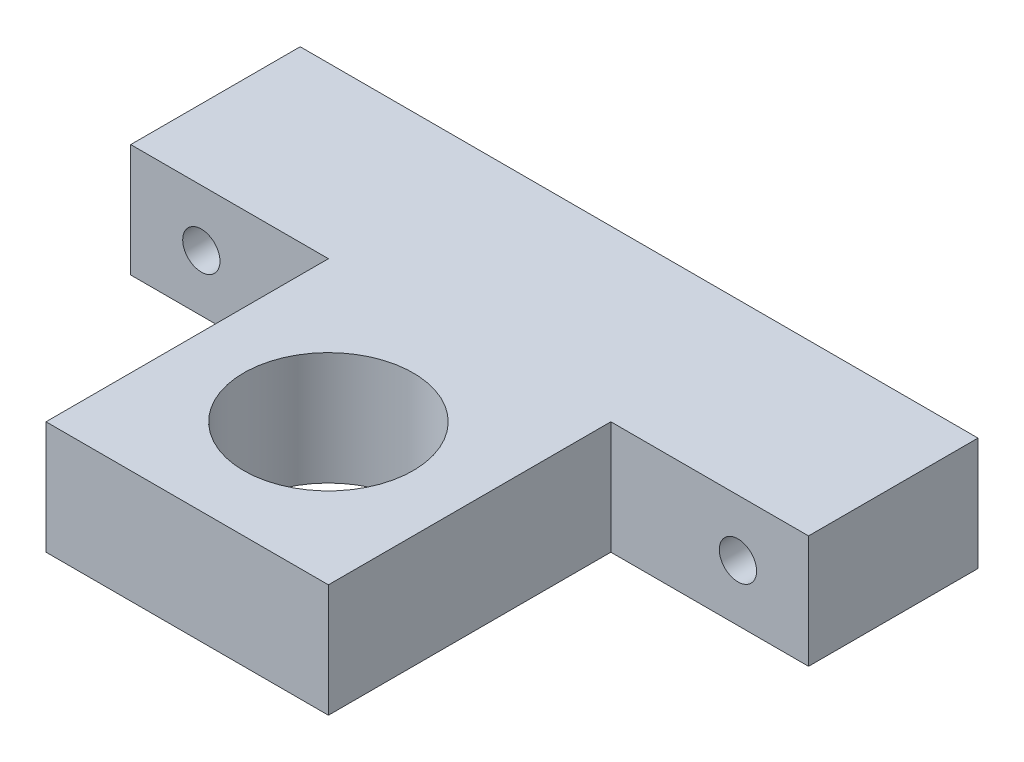
ISO-10303-21;
HEADER;
FILE_DESCRIPTION(('STEP AP214'),'2;1');
FILE_NAME('part.step','',(''),(''),'','','');
FILE_SCHEMA(('AUTOMOTIVE_DESIGN { 1 0 10303 214 1 1 1 1 }'));
ENDSEC;
DATA;
#1=APPLICATION_CONTEXT('core data for automotive mechanical design processes');
#2=APPLICATION_PROTOCOL_DEFINITION('international standard','automotive_design',2000,#1);
#3=PRODUCT_CONTEXT('',#1,'mechanical');
#4=PRODUCT('Part','Part','',(#3));
#5=PRODUCT_RELATED_PRODUCT_CATEGORY('part','',(#4));
#6=PRODUCT_DEFINITION_FORMATION('','',#4);
#7=PRODUCT_DEFINITION_CONTEXT('part definition',#1,'design');
#8=PRODUCT_DEFINITION('design','',#6,#7);
#9=PRODUCT_DEFINITION_SHAPE('','',#8);
#10=(LENGTH_UNIT() NAMED_UNIT(*) SI_UNIT(.MILLI.,.METRE.));
#11=(NAMED_UNIT(*) PLANE_ANGLE_UNIT() SI_UNIT($,.RADIAN.));
#12=(NAMED_UNIT(*) SI_UNIT($,.STERADIAN.) SOLID_ANGLE_UNIT());
#13=UNCERTAINTY_MEASURE_WITH_UNIT(LENGTH_MEASURE(1.E-05),#10,'distance_accuracy_value','');
#14=(GEOMETRIC_REPRESENTATION_CONTEXT(3) GLOBAL_UNCERTAINTY_ASSIGNED_CONTEXT((#13)) GLOBAL_UNIT_ASSIGNED_CONTEXT((#10,
#11,#12)) REPRESENTATION_CONTEXT('',''));
#15=CARTESIAN_POINT('',(0.,0.,0.));
#16=DIRECTION('',(0.,0.,1.));
#17=DIRECTION('',(1.,0.,0.));
#18=AXIS2_PLACEMENT_3D('',#15,#16,#17);
#19=CARTESIAN_POINT('',(0.,5.,0.));
#20=DIRECTION('',(0.,-1.,0.));
#21=DIRECTION('',(0.,0.,-1.));
#22=AXIS2_PLACEMENT_3D('',#19,#20,#21);
#23=PLANE('',#22);
#24=DIRECTION('',(1.,0.,0.));
#25=VECTOR('',#24,1.);
#26=CARTESIAN_POINT('',(12.5,5.,40.));
#27=LINE('',#26,#25);
#28=CARTESIAN_POINT('',(-12.5,5.,40.));
#29=VERTEX_POINT('',#28);
#30=CARTESIAN_POINT('',(12.5,5.,40.));
#31=VERTEX_POINT('',#30);
#32=EDGE_CURVE('E147',#29,#31,#27,.T.);
#33=ORIENTED_EDGE('',*,*,#32,.T.);
#34=DIRECTION('',(0.,0.,-1.));
#35=VECTOR('',#34,1.);
#36=CARTESIAN_POINT('',(12.5,5.,40.));
#37=LINE('',#36,#35);
#38=CARTESIAN_POINT('',(12.5,5.,15.));
#39=VERTEX_POINT('',#38);
#40=EDGE_CURVE('E95',#31,#39,#37,.T.);
#41=ORIENTED_EDGE('',*,*,#40,.T.);
#42=DIRECTION('',(1.,0.,0.));
#43=VECTOR('',#42,1.);
#44=CARTESIAN_POINT('',(12.5,5.,15.));
#45=LINE('',#44,#43);
#46=CARTESIAN_POINT('',(30.,5.,15.));
#47=VERTEX_POINT('',#46);
#48=EDGE_CURVE('E162',#39,#47,#45,.T.);
#49=ORIENTED_EDGE('',*,*,#48,.T.);
#50=DIRECTION('',(0.,0.,-1.));
#51=VECTOR('',#50,1.);
#52=CARTESIAN_POINT('',(30.,5.,15.));
#53=LINE('',#52,#51);
#54=CARTESIAN_POINT('',(30.,5.,0.));
#55=VERTEX_POINT('',#54);
#56=EDGE_CURVE('E175',#47,#55,#53,.T.);
#57=ORIENTED_EDGE('',*,*,#56,.T.);
#58=DIRECTION('',(-1.,0.,0.));
#59=VECTOR('',#58,1.);
#60=CARTESIAN_POINT('',(-30.,5.,0.));
#61=LINE('',#60,#59);
#62=CARTESIAN_POINT('',(-30.,5.,0.));
#63=VERTEX_POINT('',#62);
#64=EDGE_CURVE('E114',#55,#63,#61,.T.);
#65=ORIENTED_EDGE('',*,*,#64,.T.);
#66=DIRECTION('',(0.,0.,1.));
#67=VECTOR('',#66,1.);
#68=CARTESIAN_POINT('',(-30.,5.,15.));
#69=LINE('',#68,#67);
#70=CARTESIAN_POINT('',(-30.,5.,15.));
#71=VERTEX_POINT('',#70);
#72=EDGE_CURVE('E108',#63,#71,#69,.T.);
#73=ORIENTED_EDGE('',*,*,#72,.T.);
#74=DIRECTION('',(1.,0.,0.));
#75=VECTOR('',#74,1.);
#76=CARTESIAN_POINT('',(-12.5,5.,15.));
#77=LINE('',#76,#75);
#78=CARTESIAN_POINT('',(-12.5,5.,15.));
#79=VERTEX_POINT('',#78);
#80=EDGE_CURVE('E112',#71,#79,#77,.T.);
#81=ORIENTED_EDGE('',*,*,#80,.T.);
#82=DIRECTION('',(0.,0.,1.));
#83=VECTOR('',#82,1.);
#84=CARTESIAN_POINT('',(-12.5,5.,40.));
#85=LINE('',#84,#83);
#86=EDGE_CURVE('E52',#79,#29,#85,.T.);
#87=ORIENTED_EDGE('',*,*,#86,.T.);
#88=EDGE_LOOP('',(#33,#41,#49,#57,#65,#73,#81,#87));
#89=FACE_BOUND('',#88,.T.);
#90=CARTESIAN_POINT('',(0.,5.,27.5));
#91=DIRECTION('',(0.,1.,0.));
#92=DIRECTION('',(0.,0.,1.));
#93=AXIS2_PLACEMENT_3D('',#90,#91,#92);
#94=CIRCLE('',#93,7.5);
#95=CARTESIAN_POINT('',(0.,5.,35.));
#96=VERTEX_POINT('',#95);
#97=EDGE_CURVE('E136',#96,#96,#94,.T.);
#98=ORIENTED_EDGE('',*,*,#97,.F.);
#99=EDGE_LOOP('',(#98));
#100=FACE_BOUND('',#99,.T.);
#101=ADVANCED_FACE('F35',(#89,#100),#23,.F.);
#102=CARTESIAN_POINT('',(0.,-5.,0.));
#103=DIRECTION('',(0.,-1.,0.));
#104=DIRECTION('',(0.,0.,-1.));
#105=AXIS2_PLACEMENT_3D('',#102,#103,#104);
#106=PLANE('',#105);
#107=DIRECTION('',(1.,0.,0.));
#108=VECTOR('',#107,1.);
#109=CARTESIAN_POINT('',(12.5,-5.,40.));
#110=LINE('',#109,#108);
#111=CARTESIAN_POINT('',(-12.5,-5.,40.));
#112=VERTEX_POINT('',#111);
#113=CARTESIAN_POINT('',(12.5,-5.,40.));
#114=VERTEX_POINT('',#113);
#115=EDGE_CURVE('E132',#112,#114,#110,.T.);
#116=ORIENTED_EDGE('',*,*,#115,.F.);
#117=DIRECTION('',(0.,0.,1.));
#118=VECTOR('',#117,1.);
#119=CARTESIAN_POINT('',(-12.5,-5.,40.));
#120=LINE('',#119,#118);
#121=CARTESIAN_POINT('',(-12.5,-5.,15.));
#122=VERTEX_POINT('',#121);
#123=EDGE_CURVE('E87',#122,#112,#120,.T.);
#124=ORIENTED_EDGE('',*,*,#123,.F.);
#125=DIRECTION('',(1.,0.,0.));
#126=VECTOR('',#125,1.);
#127=CARTESIAN_POINT('',(-12.5,-5.,15.));
#128=LINE('',#127,#126);
#129=CARTESIAN_POINT('',(-30.,-5.,15.));
#130=VERTEX_POINT('',#129);
#131=EDGE_CURVE('E81',#130,#122,#128,.T.);
#132=ORIENTED_EDGE('',*,*,#131,.F.);
#133=DIRECTION('',(0.,0.,1.));
#134=VECTOR('',#133,1.);
#135=CARTESIAN_POINT('',(-30.,-5.,15.));
#136=LINE('',#135,#134);
#137=CARTESIAN_POINT('',(-30.,-5.,0.));
#138=VERTEX_POINT('',#137);
#139=EDGE_CURVE('E122',#138,#130,#136,.T.);
#140=ORIENTED_EDGE('',*,*,#139,.F.);
#141=DIRECTION('',(-1.,0.,0.));
#142=VECTOR('',#141,1.);
#143=CARTESIAN_POINT('',(-30.,-5.,0.));
#144=LINE('',#143,#142);
#145=CARTESIAN_POINT('',(30.,-5.,0.));
#146=VERTEX_POINT('',#145);
#147=EDGE_CURVE('E142',#146,#138,#144,.T.);
#148=ORIENTED_EDGE('',*,*,#147,.F.);
#149=DIRECTION('',(0.,0.,-1.));
#150=VECTOR('',#149,1.);
#151=CARTESIAN_POINT('',(30.,-5.,15.));
#152=LINE('',#151,#150);
#153=CARTESIAN_POINT('',(30.,-5.,15.));
#154=VERTEX_POINT('',#153);
#155=EDGE_CURVE('E140',#154,#146,#152,.T.);
#156=ORIENTED_EDGE('',*,*,#155,.F.);
#157=DIRECTION('',(1.,0.,0.));
#158=VECTOR('',#157,1.);
#159=CARTESIAN_POINT('',(12.5,-5.,15.));
#160=LINE('',#159,#158);
#161=CARTESIAN_POINT('',(12.5,-5.,15.));
#162=VERTEX_POINT('',#161);
#163=EDGE_CURVE('E138',#162,#154,#160,.T.);
#164=ORIENTED_EDGE('',*,*,#163,.F.);
#165=DIRECTION('',(0.,0.,-1.));
#166=VECTOR('',#165,1.);
#167=CARTESIAN_POINT('',(12.5,-5.,40.));
#168=LINE('',#167,#166);
#169=EDGE_CURVE('E135',#114,#162,#168,.T.);
#170=ORIENTED_EDGE('',*,*,#169,.F.);
#171=EDGE_LOOP('',(#116,#124,#132,#140,#148,#156,#164,#170));
#172=FACE_BOUND('',#171,.T.);
#173=CARTESIAN_POINT('',(0.,-5.,27.5));
#174=DIRECTION('',(0.,1.,0.));
#175=DIRECTION('',(0.,0.,1.));
#176=AXIS2_PLACEMENT_3D('',#173,#174,#175);
#177=CIRCLE('',#176,7.5);
#178=CARTESIAN_POINT('',(0.,-5.,35.));
#179=VERTEX_POINT('',#178);
#180=EDGE_CURVE('E181',#179,#179,#177,.T.);
#181=ORIENTED_EDGE('',*,*,#180,.T.);
#182=EDGE_LOOP('',(#181));
#183=FACE_BOUND('',#182,.T.);
#184=ADVANCED_FACE('F166',(#172,#183),#106,.T.);
#185=CARTESIAN_POINT('',(12.5,5.,40.));
#186=DIRECTION('',(0.,0.,-1.));
#187=DIRECTION('',(-1.,0.,0.));
#188=AXIS2_PLACEMENT_3D('',#185,#186,#187);
#189=PLANE('',#188);
#190=ORIENTED_EDGE('',*,*,#115,.T.);
#191=DIRECTION('',(0.,-1.,0.));
#192=VECTOR('',#191,1.);
#193=CARTESIAN_POINT('',(12.5,5.,40.));
#194=LINE('',#193,#192);
#195=EDGE_CURVE('E11',#31,#114,#194,.T.);
#196=ORIENTED_EDGE('',*,*,#195,.F.);
#197=ORIENTED_EDGE('',*,*,#32,.F.);
#198=DIRECTION('',(0.,-1.,0.));
#199=VECTOR('',#198,1.);
#200=CARTESIAN_POINT('',(-12.5,5.,40.));
#201=LINE('',#200,#199);
#202=EDGE_CURVE('E128',#29,#112,#201,.T.);
#203=ORIENTED_EDGE('',*,*,#202,.T.);
#204=EDGE_LOOP('',(#190,#196,#197,#203));
#205=FACE_BOUND('',#204,.T.);
#206=ADVANCED_FACE('F37',(#205),#189,.F.);
#207=CARTESIAN_POINT('',(12.5,5.,40.));
#208=DIRECTION('',(-1.,0.,0.));
#209=DIRECTION('',(0.,0.,1.));
#210=AXIS2_PLACEMENT_3D('',#207,#208,#209);
#211=PLANE('',#210);
#212=ORIENTED_EDGE('',*,*,#169,.T.);
#213=DIRECTION('',(0.,-1.,0.));
#214=VECTOR('',#213,1.);
#215=CARTESIAN_POINT('',(12.5,5.,15.));
#216=LINE('',#215,#214);
#217=EDGE_CURVE('E44',#39,#162,#216,.T.);
#218=ORIENTED_EDGE('',*,*,#217,.F.);
#219=ORIENTED_EDGE('',*,*,#40,.F.);
#220=ORIENTED_EDGE('',*,*,#195,.T.);
#221=EDGE_LOOP('',(#212,#218,#219,#220));
#222=FACE_BOUND('',#221,.T.);
#223=ADVANCED_FACE('F272',(#222),#211,.F.);
#224=CARTESIAN_POINT('',(12.5,5.,15.));
#225=DIRECTION('',(0.,0.,-1.));
#226=DIRECTION('',(-1.,0.,0.));
#227=AXIS2_PLACEMENT_3D('',#224,#225,#226);
#228=PLANE('',#227);
#229=CARTESIAN_POINT('',(23.75,0.,15.));
#230=DIRECTION('',(0.,0.,-1.));
#231=DIRECTION('',(-1.,0.,0.));
#232=AXIS2_PLACEMENT_3D('',#229,#230,#231);
#233=CIRCLE('',#232,1.64999999999999);
#234=CARTESIAN_POINT('',(22.1,0.,15.));
#235=VERTEX_POINT('',#234);
#236=EDGE_CURVE('E192',#235,#235,#233,.T.);
#237=ORIENTED_EDGE('',*,*,#236,.T.);
#238=EDGE_LOOP('',(#237));
#239=FACE_BOUND('',#238,.T.);
#240=ORIENTED_EDGE('',*,*,#163,.T.);
#241=DIRECTION('',(0.,-1.,0.));
#242=VECTOR('',#241,1.);
#243=CARTESIAN_POINT('',(30.,5.,15.));
#244=LINE('',#243,#242);
#245=EDGE_CURVE('E154',#47,#154,#244,.T.);
#246=ORIENTED_EDGE('',*,*,#245,.F.);
#247=ORIENTED_EDGE('',*,*,#48,.F.);
#248=ORIENTED_EDGE('',*,*,#217,.T.);
#249=EDGE_LOOP('',(#240,#246,#247,#248));
#250=FACE_BOUND('',#249,.T.);
#251=ADVANCED_FACE('F160',(#239,#250),#228,.F.);
#252=CARTESIAN_POINT('',(30.,5.,15.));
#253=DIRECTION('',(-1.,0.,0.));
#254=DIRECTION('',(0.,0.,1.));
#255=AXIS2_PLACEMENT_3D('',#252,#253,#254);
#256=PLANE('',#255);
#257=ORIENTED_EDGE('',*,*,#155,.T.);
#258=DIRECTION('',(0.,-1.,0.));
#259=VECTOR('',#258,1.);
#260=CARTESIAN_POINT('',(30.,5.,0.));
#261=LINE('',#260,#259);
#262=EDGE_CURVE('E151',#55,#146,#261,.T.);
#263=ORIENTED_EDGE('',*,*,#262,.F.);
#264=ORIENTED_EDGE('',*,*,#56,.F.);
#265=ORIENTED_EDGE('',*,*,#245,.T.);
#266=EDGE_LOOP('',(#257,#263,#264,#265));
#267=FACE_BOUND('',#266,.T.);
#268=ADVANCED_FACE('F171',(#267),#256,.F.);
#269=CARTESIAN_POINT('',(-30.,5.,0.));
#270=DIRECTION('',(0.,0.,1.));
#271=DIRECTION('',(1.,0.,0.));
#272=AXIS2_PLACEMENT_3D('',#269,#270,#271);
#273=PLANE('',#272);
#274=CARTESIAN_POINT('',(23.75,0.,0.));
#275=DIRECTION('',(0.,0.,-1.));
#276=DIRECTION('',(-1.,0.,0.));
#277=AXIS2_PLACEMENT_3D('',#274,#275,#276);
#278=CIRCLE('',#277,1.64999999999999);
#279=CARTESIAN_POINT('',(22.1,0.,0.));
#280=VERTEX_POINT('',#279);
#281=EDGE_CURVE('E195',#280,#280,#278,.T.);
#282=ORIENTED_EDGE('',*,*,#281,.F.);
#283=EDGE_LOOP('',(#282));
#284=FACE_BOUND('',#283,.T.);
#285=CARTESIAN_POINT('',(-23.75,0.,0.));
#286=DIRECTION('',(0.,0.,-1.));
#287=DIRECTION('',(-1.,0.,0.));
#288=AXIS2_PLACEMENT_3D('',#285,#286,#287);
#289=CIRCLE('',#288,1.64999999999999);
#290=CARTESIAN_POINT('',(-25.4,0.,0.));
#291=VERTEX_POINT('',#290);
#292=EDGE_CURVE('E189',#291,#291,#289,.T.);
#293=ORIENTED_EDGE('',*,*,#292,.F.);
#294=EDGE_LOOP('',(#293));
#295=FACE_BOUND('',#294,.T.);
#296=ORIENTED_EDGE('',*,*,#147,.T.);
#297=DIRECTION('',(0.,-1.,0.));
#298=VECTOR('',#297,1.);
#299=CARTESIAN_POINT('',(-30.,5.,0.));
#300=LINE('',#299,#298);
#301=EDGE_CURVE('E123',#63,#138,#300,.T.);
#302=ORIENTED_EDGE('',*,*,#301,.F.);
#303=ORIENTED_EDGE('',*,*,#64,.F.);
#304=ORIENTED_EDGE('',*,*,#262,.T.);
#305=EDGE_LOOP('',(#296,#302,#303,#304));
#306=FACE_BOUND('',#305,.T.);
#307=ADVANCED_FACE('F174',(#284,#295,#306),#273,.F.);
#308=CARTESIAN_POINT('',(-30.,5.,15.));
#309=DIRECTION('',(1.,0.,0.));
#310=DIRECTION('',(0.,0.,-1.));
#311=AXIS2_PLACEMENT_3D('',#308,#309,#310);
#312=PLANE('',#311);
#313=ORIENTED_EDGE('',*,*,#139,.T.);
#314=DIRECTION('',(0.,-1.,0.));
#315=VECTOR('',#314,1.);
#316=CARTESIAN_POINT('',(-30.,5.,15.));
#317=LINE('',#316,#315);
#318=EDGE_CURVE('E119',#71,#130,#317,.T.);
#319=ORIENTED_EDGE('',*,*,#318,.F.);
#320=ORIENTED_EDGE('',*,*,#72,.F.);
#321=ORIENTED_EDGE('',*,*,#301,.T.);
#322=EDGE_LOOP('',(#313,#319,#320,#321));
#323=FACE_BOUND('',#322,.T.);
#324=ADVANCED_FACE('F120',(#323),#312,.F.);
#325=CARTESIAN_POINT('',(-12.5,5.,15.));
#326=DIRECTION('',(0.,0.,-1.));
#327=DIRECTION('',(-1.,0.,0.));
#328=AXIS2_PLACEMENT_3D('',#325,#326,#327);
#329=PLANE('',#328);
#330=CARTESIAN_POINT('',(-23.75,0.,15.));
#331=DIRECTION('',(0.,0.,-1.));
#332=DIRECTION('',(-1.,0.,0.));
#333=AXIS2_PLACEMENT_3D('',#330,#331,#332);
#334=CIRCLE('',#333,1.64999999999999);
#335=CARTESIAN_POINT('',(-25.4,0.,15.));
#336=VERTEX_POINT('',#335);
#337=EDGE_CURVE('E184',#336,#336,#334,.T.);
#338=ORIENTED_EDGE('',*,*,#337,.T.);
#339=EDGE_LOOP('',(#338));
#340=FACE_BOUND('',#339,.T.);
#341=ORIENTED_EDGE('',*,*,#131,.T.);
#342=DIRECTION('',(0.,-1.,0.));
#343=VECTOR('',#342,1.);
#344=CARTESIAN_POINT('',(-12.5,5.,15.));
#345=LINE('',#344,#343);
#346=EDGE_CURVE('E124',#79,#122,#345,.T.);
#347=ORIENTED_EDGE('',*,*,#346,.F.);
#348=ORIENTED_EDGE('',*,*,#80,.F.);
#349=ORIENTED_EDGE('',*,*,#318,.T.);
#350=EDGE_LOOP('',(#341,#347,#348,#349));
#351=FACE_BOUND('',#350,.T.);
#352=ADVANCED_FACE('F126',(#340,#351),#329,.F.);
#353=CARTESIAN_POINT('',(-12.5,5.,40.));
#354=DIRECTION('',(1.,0.,0.));
#355=DIRECTION('',(0.,0.,-1.));
#356=AXIS2_PLACEMENT_3D('',#353,#354,#355);
#357=PLANE('',#356);
#358=ORIENTED_EDGE('',*,*,#123,.T.);
#359=ORIENTED_EDGE('',*,*,#202,.F.);
#360=ORIENTED_EDGE('',*,*,#86,.F.);
#361=ORIENTED_EDGE('',*,*,#346,.T.);
#362=EDGE_LOOP('',(#358,#359,#360,#361));
#363=FACE_BOUND('',#362,.T.);
#364=ADVANCED_FACE('F215',(#363),#357,.F.);
#365=CARTESIAN_POINT('',(0.,5.,27.5));
#366=DIRECTION('',(0.,-1.,0.));
#367=DIRECTION('',(0.,0.,-1.));
#368=AXIS2_PLACEMENT_3D('',#365,#366,#367);
#369=CYLINDRICAL_SURFACE('',#368,7.5);
#370=ORIENTED_EDGE('',*,*,#97,.T.);
#371=EDGE_LOOP('',(#370));
#372=FACE_BOUND('',#371,.T.);
#373=ORIENTED_EDGE('',*,*,#180,.F.);
#374=EDGE_LOOP('',(#373));
#375=FACE_BOUND('',#374,.T.);
#376=ADVANCED_FACE('F210',(#372,#375),#369,.F.);
#377=CARTESIAN_POINT('',(-23.75,0.,0.));
#378=DIRECTION('',(0.,0.,-1.));
#379=DIRECTION('',(-1.,0.,0.));
#380=AXIS2_PLACEMENT_3D('',#377,#378,#379);
#381=CYLINDRICAL_SURFACE('',#380,1.64999999999999);
#382=ORIENTED_EDGE('',*,*,#292,.T.);
#383=EDGE_LOOP('',(#382));
#384=FACE_BOUND('',#383,.T.);
#385=ORIENTED_EDGE('',*,*,#337,.F.);
#386=EDGE_LOOP('',(#385));
#387=FACE_BOUND('',#386,.T.);
#388=ADVANCED_FACE('F207',(#384,#387),#381,.F.);
#389=CARTESIAN_POINT('',(23.75,0.,0.));
#390=DIRECTION('',(0.,0.,-1.));
#391=DIRECTION('',(-1.,0.,0.));
#392=AXIS2_PLACEMENT_3D('',#389,#390,#391);
#393=CYLINDRICAL_SURFACE('',#392,1.64999999999999);
#394=ORIENTED_EDGE('',*,*,#281,.T.);
#395=EDGE_LOOP('',(#394));
#396=FACE_BOUND('',#395,.T.);
#397=ORIENTED_EDGE('',*,*,#236,.F.);
#398=EDGE_LOOP('',(#397));
#399=FACE_BOUND('',#398,.T.);
#400=ADVANCED_FACE('F199',(#396,#399),#393,.F.);
#401=CLOSED_SHELL('',(#101,#184,#206,#223,#251,#268,#307,#324,#352,#364,#376,#388,#400));
#402=MANIFOLD_SOLID_BREP('B2',#401);
#403=ADVANCED_BREP_SHAPE_REPRESENTATION('',(#18,#402),#14);
#404=SHAPE_DEFINITION_REPRESENTATION(#9,#403);
ENDSEC;
END-ISO-10303-21;
